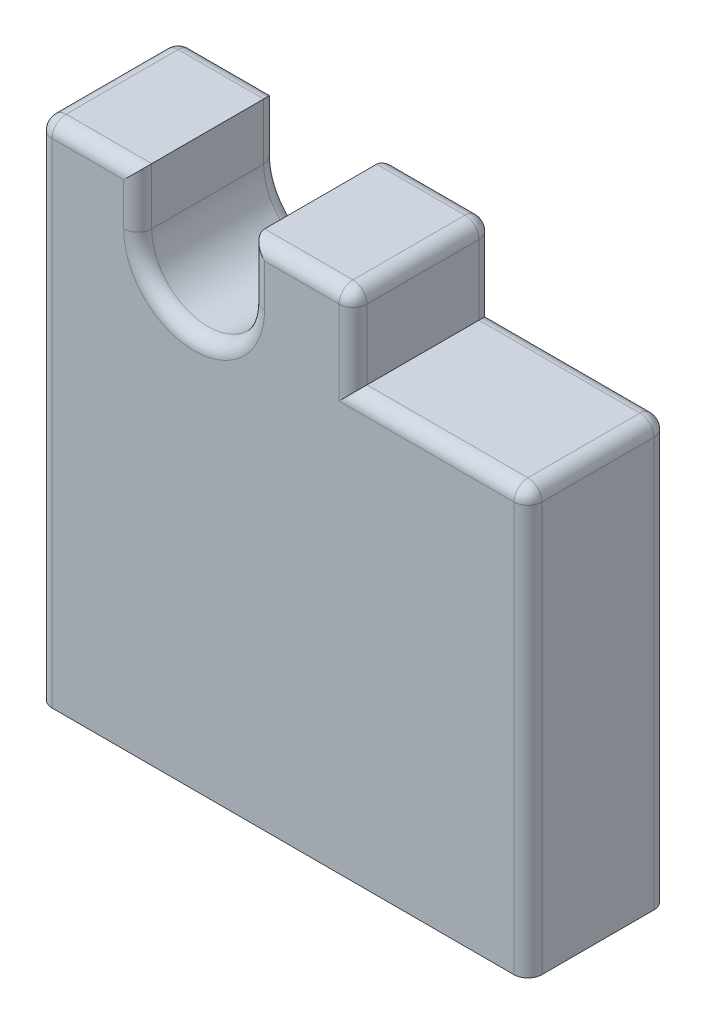
ISO-10303-21;
HEADER;
FILE_DESCRIPTION(('STEP AP214'),'2;1');
FILE_NAME('part.step','',(''),(''),'','','');
FILE_SCHEMA(('AUTOMOTIVE_DESIGN { 1 0 10303 214 1 1 1 1 }'));
ENDSEC;
DATA;
#1=APPLICATION_CONTEXT('core data for automotive mechanical design processes');
#2=APPLICATION_PROTOCOL_DEFINITION('international standard','automotive_design',2000,#1);
#3=PRODUCT_CONTEXT('',#1,'mechanical');
#4=PRODUCT('Part','Part','',(#3));
#5=PRODUCT_RELATED_PRODUCT_CATEGORY('part','',(#4));
#6=PRODUCT_DEFINITION_FORMATION('','',#4);
#7=PRODUCT_DEFINITION_CONTEXT('part definition',#1,'design');
#8=PRODUCT_DEFINITION('design','',#6,#7);
#9=PRODUCT_DEFINITION_SHAPE('','',#8);
#10=(LENGTH_UNIT() NAMED_UNIT(*) SI_UNIT(.MILLI.,.METRE.));
#11=(NAMED_UNIT(*) PLANE_ANGLE_UNIT() SI_UNIT($,.RADIAN.));
#12=(NAMED_UNIT(*) SI_UNIT($,.STERADIAN.) SOLID_ANGLE_UNIT());
#13=UNCERTAINTY_MEASURE_WITH_UNIT(LENGTH_MEASURE(1.E-05),#10,'distance_accuracy_value','');
#14=(GEOMETRIC_REPRESENTATION_CONTEXT(3) GLOBAL_UNCERTAINTY_ASSIGNED_CONTEXT((#13)) GLOBAL_UNIT_ASSIGNED_CONTEXT((#10,
#11,#12)) REPRESENTATION_CONTEXT('',''));
#15=CARTESIAN_POINT('',(0.,0.,0.));
#16=DIRECTION('',(0.,0.,1.));
#17=DIRECTION('',(1.,0.,0.));
#18=AXIS2_PLACEMENT_3D('',#15,#16,#17);
#19=CARTESIAN_POINT('',(88.9,0.,25.4));
#20=DIRECTION('',(0.,1.,0.));
#21=DIRECTION('',(0.,0.,1.));
#22=AXIS2_PLACEMENT_3D('',#19,#20,#21);
#23=PLANE('',#22);
#24=DIRECTION('',(0.,0.,-1.));
#25=VECTOR('',#24,1.);
#26=CARTESIAN_POINT('',(0.,0.,25.4));
#27=LINE('',#26,#25);
#28=CARTESIAN_POINT('',(0.,0.,22.86));
#29=VERTEX_POINT('',#28);
#30=CARTESIAN_POINT('',(0.,0.,2.54));
#31=VERTEX_POINT('',#30);
#32=EDGE_CURVE('E523',#29,#31,#27,.T.);
#33=ORIENTED_EDGE('',*,*,#32,.T.);
#34=CARTESIAN_POINT('',(2.54,0.,2.54));
#35=DIRECTION('',(0.,1.,0.));
#36=DIRECTION('',(0.,0.,1.));
#37=AXIS2_PLACEMENT_3D('',#34,#35,#36);
#38=CIRCLE('',#37,2.54);
#39=CARTESIAN_POINT('',(2.54,0.,0.));
#40=VERTEX_POINT('',#39);
#41=EDGE_CURVE('E351',#31,#40,#38,.F.);
#42=ORIENTED_EDGE('',*,*,#41,.T.);
#43=DIRECTION('',(1.,0.,0.));
#44=VECTOR('',#43,1.);
#45=CARTESIAN_POINT('',(88.9,0.,0.));
#46=LINE('',#45,#44);
#47=CARTESIAN_POINT('',(86.36,0.,0.));
#48=VERTEX_POINT('',#47);
#49=EDGE_CURVE('E436',#40,#48,#46,.T.);
#50=ORIENTED_EDGE('',*,*,#49,.T.);
#51=CARTESIAN_POINT('',(86.36,0.,2.54));
#52=DIRECTION('',(0.,1.,0.));
#53=DIRECTION('',(0.,0.,1.));
#54=AXIS2_PLACEMENT_3D('',#51,#52,#53);
#55=CIRCLE('',#54,2.54);
#56=CARTESIAN_POINT('',(88.9,0.,2.54));
#57=VERTEX_POINT('',#56);
#58=EDGE_CURVE('E348',#48,#57,#55,.F.);
#59=ORIENTED_EDGE('',*,*,#58,.T.);
#60=DIRECTION('',(0.,0.,-1.));
#61=VECTOR('',#60,1.);
#62=CARTESIAN_POINT('',(88.9,0.,25.4));
#63=LINE('',#62,#61);
#64=CARTESIAN_POINT('',(88.9,0.,22.86));
#65=VERTEX_POINT('',#64);
#66=EDGE_CURVE('E249',#65,#57,#63,.T.);
#67=ORIENTED_EDGE('',*,*,#66,.F.);
#68=CARTESIAN_POINT('',(86.36,0.,22.86));
#69=DIRECTION('',(0.,1.,0.));
#70=DIRECTION('',(0.,0.,1.));
#71=AXIS2_PLACEMENT_3D('',#68,#69,#70);
#72=CIRCLE('',#71,2.54);
#73=CARTESIAN_POINT('',(86.36,0.,25.4));
#74=VERTEX_POINT('',#73);
#75=EDGE_CURVE('E345',#65,#74,#72,.F.);
#76=ORIENTED_EDGE('',*,*,#75,.T.);
#77=DIRECTION('',(1.,0.,0.));
#78=VECTOR('',#77,1.);
#79=CARTESIAN_POINT('',(88.9,0.,25.4));
#80=LINE('',#79,#78);
#81=CARTESIAN_POINT('',(2.54,0.,25.4));
#82=VERTEX_POINT('',#81);
#83=EDGE_CURVE('E584',#82,#74,#80,.T.);
#84=ORIENTED_EDGE('',*,*,#83,.F.);
#85=CARTESIAN_POINT('',(2.54,0.,22.86));
#86=DIRECTION('',(0.,1.,0.));
#87=DIRECTION('',(0.,0.,1.));
#88=AXIS2_PLACEMENT_3D('',#85,#86,#87);
#89=CIRCLE('',#88,2.54);
#90=EDGE_CURVE('E342',#82,#29,#89,.F.);
#91=ORIENTED_EDGE('',*,*,#90,.T.);
#92=EDGE_LOOP('',(#33,#42,#50,#59,#67,#76,#84,#91));
#93=FACE_BOUND('',#92,.T.);
#94=ADVANCED_FACE('F47',(#93),#23,.F.);
#95=CARTESIAN_POINT('',(88.9,76.835,25.4));
#96=DIRECTION('',(-1.,0.,0.));
#97=DIRECTION('',(0.,-1.,0.));
#98=AXIS2_PLACEMENT_3D('',#95,#96,#97);
#99=PLANE('',#98);
#100=ORIENTED_EDGE('',*,*,#66,.T.);
#101=DIRECTION('',(0.,1.,0.));
#102=VECTOR('',#101,1.);
#103=CARTESIAN_POINT('',(88.9,76.835,2.54));
#104=LINE('',#103,#102);
#105=CARTESIAN_POINT('',(88.9,74.295,2.54));
#106=VERTEX_POINT('',#105);
#107=EDGE_CURVE('E360',#57,#106,#104,.T.);
#108=ORIENTED_EDGE('',*,*,#107,.T.);
#109=DIRECTION('',(0.,0.,-1.));
#110=VECTOR('',#109,1.);
#111=CARTESIAN_POINT('',(88.9,74.295,25.4));
#112=LINE('',#111,#110);
#113=CARTESIAN_POINT('',(88.9,74.295,22.86));
#114=VERTEX_POINT('',#113);
#115=EDGE_CURVE('E354',#106,#114,#112,.F.);
#116=ORIENTED_EDGE('',*,*,#115,.T.);
#117=DIRECTION('',(0.,1.,0.));
#118=VECTOR('',#117,1.);
#119=CARTESIAN_POINT('',(88.9,0.,22.86));
#120=LINE('',#119,#118);
#121=EDGE_CURVE('E357',#114,#65,#120,.F.);
#122=ORIENTED_EDGE('',*,*,#121,.T.);
#123=EDGE_LOOP('',(#100,#108,#116,#122));
#124=FACE_BOUND('',#123,.T.);
#125=ADVANCED_FACE('F619',(#124),#99,.F.);
#126=CARTESIAN_POINT('',(57.15,76.835,25.4));
#127=DIRECTION('',(0.,-1.,0.));
#128=DIRECTION('',(0.,0.,-1.));
#129=AXIS2_PLACEMENT_3D('',#126,#127,#128);
#130=PLANE('',#129);
#131=DIRECTION('',(0.,0.,-1.));
#132=VECTOR('',#131,1.);
#133=CARTESIAN_POINT('',(86.36,76.835,25.4));
#134=LINE('',#133,#132);
#135=CARTESIAN_POINT('',(86.36,76.835,22.86));
#136=VERTEX_POINT('',#135);
#137=CARTESIAN_POINT('',(86.36,76.835,2.54));
#138=VERTEX_POINT('',#137);
#139=EDGE_CURVE('E370',#136,#138,#134,.T.);
#140=ORIENTED_EDGE('',*,*,#139,.T.);
#141=DIRECTION('',(-1.,0.,0.));
#142=VECTOR('',#141,1.);
#143=CARTESIAN_POINT('',(57.15,76.835,2.54));
#144=LINE('',#143,#142);
#145=CARTESIAN_POINT('',(57.15,76.835,2.54));
#146=VERTEX_POINT('',#145);
#147=EDGE_CURVE('E376',#138,#146,#144,.T.);
#148=ORIENTED_EDGE('',*,*,#147,.T.);
#149=DIRECTION('',(0.,0.,-1.));
#150=VECTOR('',#149,1.);
#151=CARTESIAN_POINT('',(57.15,76.835,25.4));
#152=LINE('',#151,#150);
#153=CARTESIAN_POINT('',(57.15,76.835,22.86));
#154=VERTEX_POINT('',#153);
#155=EDGE_CURVE('E256',#154,#146,#152,.T.);
#156=ORIENTED_EDGE('',*,*,#155,.F.);
#157=DIRECTION('',(-1.,0.,0.));
#158=VECTOR('',#157,1.);
#159=CARTESIAN_POINT('',(88.9,76.835,22.86));
#160=LINE('',#159,#158);
#161=EDGE_CURVE('E373',#154,#136,#160,.F.);
#162=ORIENTED_EDGE('',*,*,#161,.T.);
#163=EDGE_LOOP('',(#140,#148,#156,#162));
#164=FACE_BOUND('',#163,.T.);
#165=ADVANCED_FACE('F565',(#164),#130,.F.);
#166=CARTESIAN_POINT('',(57.15,92.075,25.4));
#167=DIRECTION('',(-1.,0.,0.));
#168=DIRECTION('',(0.,0.,1.));
#169=AXIS2_PLACEMENT_3D('',#166,#167,#168);
#170=PLANE('',#169);
#171=DIRECTION('',(0.,1.,0.));
#172=VECTOR('',#171,1.);
#173=CARTESIAN_POINT('',(57.15,92.075,2.54));
#174=LINE('',#173,#172);
#175=CARTESIAN_POINT('',(57.15,89.535,2.54));
#176=VERTEX_POINT('',#175);
#177=EDGE_CURVE('E366',#146,#176,#174,.T.);
#178=ORIENTED_EDGE('',*,*,#177,.T.);
#179=DIRECTION('',(0.,0.,-1.));
#180=VECTOR('',#179,1.);
#181=CARTESIAN_POINT('',(57.15,89.535,25.4));
#182=LINE('',#181,#180);
#183=CARTESIAN_POINT('',(57.15,89.535,22.86));
#184=VERTEX_POINT('',#183);
#185=EDGE_CURVE('E464',#176,#184,#182,.F.);
#186=ORIENTED_EDGE('',*,*,#185,.T.);
#187=DIRECTION('',(0.,1.,0.));
#188=VECTOR('',#187,1.);
#189=CARTESIAN_POINT('',(57.15,76.835,22.86));
#190=LINE('',#189,#188);
#191=EDGE_CURVE('E363',#184,#154,#190,.F.);
#192=ORIENTED_EDGE('',*,*,#191,.T.);
#193=ORIENTED_EDGE('',*,*,#155,.T.);
#194=EDGE_LOOP('',(#178,#186,#192,#193));
#195=FACE_BOUND('',#194,.T.);
#196=ADVANCED_FACE('F533',(#195),#170,.F.);
#197=CARTESIAN_POINT('',(38.575,92.075,25.4));
#198=DIRECTION('',(0.,-1.,0.));
#199=DIRECTION('',(0.,0.,-1.));
#200=AXIS2_PLACEMENT_3D('',#197,#198,#199);
#201=PLANE('',#200);
#202=DIRECTION('',(-1.,0.,0.));
#203=VECTOR('',#202,1.);
#204=CARTESIAN_POINT('',(57.15,92.075,22.86));
#205=LINE('',#204,#203);
#206=CARTESIAN_POINT('',(38.575,92.075,22.86));
#207=VERTEX_POINT('',#206);
#208=CARTESIAN_POINT('',(54.61,92.075,22.86));
#209=VERTEX_POINT('',#208);
#210=EDGE_CURVE('E329',#207,#209,#205,.F.);
#211=ORIENTED_EDGE('',*,*,#210,.T.);
#212=DIRECTION('',(0.,0.,-1.));
#213=VECTOR('',#212,1.);
#214=CARTESIAN_POINT('',(54.61,92.075,25.4));
#215=LINE('',#214,#213);
#216=CARTESIAN_POINT('',(54.61,92.075,2.54));
#217=VERTEX_POINT('',#216);
#218=EDGE_CURVE('E461',#209,#217,#215,.T.);
#219=ORIENTED_EDGE('',*,*,#218,.T.);
#220=DIRECTION('',(-1.,0.,0.));
#221=VECTOR('',#220,1.);
#222=CARTESIAN_POINT('',(38.575,92.075,2.54));
#223=LINE('',#222,#221);
#224=CARTESIAN_POINT('',(38.575,92.075,2.54));
#225=VERTEX_POINT('',#224);
#226=EDGE_CURVE('E333',#217,#225,#223,.T.);
#227=ORIENTED_EDGE('',*,*,#226,.T.);
#228=DIRECTION('',(0.,0.,-1.));
#229=VECTOR('',#228,1.);
#230=CARTESIAN_POINT('',(38.575,92.075,25.4));
#231=LINE('',#230,#229);
#232=EDGE_CURVE('E231',#207,#225,#231,.T.);
#233=ORIENTED_EDGE('',*,*,#232,.F.);
#234=EDGE_LOOP('',(#211,#219,#227,#233));
#235=FACE_BOUND('',#234,.T.);
#236=ADVANCED_FACE('F737',(#235),#201,.F.);
#237=CARTESIAN_POINT('',(38.575,81.825,25.4));
#238=DIRECTION('',(1.,0.,0.));
#239=DIRECTION('',(0.,0.,-1.));
#240=AXIS2_PLACEMENT_3D('',#237,#238,#239);
#241=PLANE('',#240);
#242=ORIENTED_EDGE('',*,*,#232,.T.);
#243=DIRECTION('',(0.,-1.,0.));
#244=VECTOR('',#243,1.);
#245=CARTESIAN_POINT('',(38.575,81.825,2.54));
#246=LINE('',#245,#244);
#247=CARTESIAN_POINT('',(38.575,81.825,2.54));
#248=VERTEX_POINT('',#247);
#249=EDGE_CURVE('E229',#225,#248,#246,.T.);
#250=ORIENTED_EDGE('',*,*,#249,.T.);
#251=DIRECTION('',(0.,0.,-1.));
#252=VECTOR('',#251,1.);
#253=CARTESIAN_POINT('',(38.575,81.825,25.4));
#254=LINE('',#253,#252);
#255=CARTESIAN_POINT('',(38.575,81.825,22.86));
#256=VERTEX_POINT('',#255);
#257=EDGE_CURVE('E210',#256,#248,#254,.T.);
#258=ORIENTED_EDGE('',*,*,#257,.F.);
#259=DIRECTION('',(0.,-1.,0.));
#260=VECTOR('',#259,1.);
#261=CARTESIAN_POINT('',(38.575,92.075,22.86));
#262=LINE('',#261,#260);
#263=EDGE_CURVE('E226',#256,#207,#262,.F.);
#264=ORIENTED_EDGE('',*,*,#263,.T.);
#265=EDGE_LOOP('',(#242,#250,#258,#264));
#266=FACE_BOUND('',#265,.T.);
#267=ADVANCED_FACE('F224',(#266),#241,.F.);
#268=CARTESIAN_POINT('',(28.325,81.825,25.4));
#269=DIRECTION('',(0.,0.,-1.));
#270=DIRECTION('',(-1.,0.,0.));
#271=AXIS2_PLACEMENT_3D('',#268,#269,#270);
#272=CYLINDRICAL_SURFACE('',#271,10.25);
#273=ORIENTED_EDGE('',*,*,#257,.T.);
#274=CARTESIAN_POINT('',(28.325,81.825,2.54));
#275=DIRECTION('',(0.,0.,1.));
#276=DIRECTION('',(1.,0.,0.));
#277=AXIS2_PLACEMENT_3D('',#274,#275,#276);
#278=CIRCLE('',#277,10.25);
#279=CARTESIAN_POINT('',(18.075,81.825,2.54));
#280=VERTEX_POINT('',#279);
#281=EDGE_CURVE('E218',#248,#280,#278,.F.);
#282=ORIENTED_EDGE('',*,*,#281,.T.);
#283=DIRECTION('',(0.,0.,-1.));
#284=VECTOR('',#283,1.);
#285=CARTESIAN_POINT('',(18.075,81.825,25.4));
#286=LINE('',#285,#284);
#287=CARTESIAN_POINT('',(18.075,81.825,22.86));
#288=VERTEX_POINT('',#287);
#289=EDGE_CURVE('E212',#288,#280,#286,.T.);
#290=ORIENTED_EDGE('',*,*,#289,.F.);
#291=CARTESIAN_POINT('',(28.325,81.825,22.86));
#292=DIRECTION('',(0.,0.,1.));
#293=DIRECTION('',(1.,0.,0.));
#294=AXIS2_PLACEMENT_3D('',#291,#292,#293);
#295=CIRCLE('',#294,10.25);
#296=EDGE_CURVE('E207',#288,#256,#295,.T.);
#297=ORIENTED_EDGE('',*,*,#296,.T.);
#298=EDGE_LOOP('',(#273,#282,#290,#297));
#299=FACE_BOUND('',#298,.T.);
#300=ADVANCED_FACE('F209',(#299),#272,.F.);
#301=CARTESIAN_POINT('',(18.075,92.075,25.4));
#302=DIRECTION('',(-1.,0.,0.));
#303=DIRECTION('',(0.,0.,1.));
#304=AXIS2_PLACEMENT_3D('',#301,#302,#303);
#305=PLANE('',#304);
#306=ORIENTED_EDGE('',*,*,#289,.T.);
#307=DIRECTION('',(0.,1.,0.));
#308=VECTOR('',#307,1.);
#309=CARTESIAN_POINT('',(18.075,92.075,2.54));
#310=LINE('',#309,#308);
#311=CARTESIAN_POINT('',(18.075,92.075,2.54));
#312=VERTEX_POINT('',#311);
#313=EDGE_CURVE('E291',#280,#312,#310,.T.);
#314=ORIENTED_EDGE('',*,*,#313,.T.);
#315=DIRECTION('',(0.,0.,-1.));
#316=VECTOR('',#315,1.);
#317=CARTESIAN_POINT('',(18.075,92.075,25.4));
#318=LINE('',#317,#316);
#319=CARTESIAN_POINT('',(18.075,92.075,22.86));
#320=VERTEX_POINT('',#319);
#321=EDGE_CURVE('E520',#320,#312,#318,.T.);
#322=ORIENTED_EDGE('',*,*,#321,.F.);
#323=DIRECTION('',(0.,1.,0.));
#324=VECTOR('',#323,1.);
#325=CARTESIAN_POINT('',(18.075,81.825,22.86));
#326=LINE('',#325,#324);
#327=EDGE_CURVE('E288',#320,#288,#326,.F.);
#328=ORIENTED_EDGE('',*,*,#327,.T.);
#329=EDGE_LOOP('',(#306,#314,#322,#328));
#330=FACE_BOUND('',#329,.T.);
#331=ADVANCED_FACE('F515',(#330),#305,.F.);
#332=CARTESIAN_POINT('',(0.,92.075,25.4));
#333=DIRECTION('',(0.,-1.,0.));
#334=DIRECTION('',(0.,0.,-1.));
#335=AXIS2_PLACEMENT_3D('',#332,#333,#334);
#336=PLANE('',#335);
#337=DIRECTION('',(-1.,0.,0.));
#338=VECTOR('',#337,1.);
#339=CARTESIAN_POINT('',(0.,92.075,2.54));
#340=LINE('',#339,#338);
#341=CARTESIAN_POINT('',(2.54,92.075,2.54));
#342=VERTEX_POINT('',#341);
#343=EDGE_CURVE('E326',#312,#342,#340,.T.);
#344=ORIENTED_EDGE('',*,*,#343,.T.);
#345=DIRECTION('',(0.,0.,-1.));
#346=VECTOR('',#345,1.);
#347=CARTESIAN_POINT('',(2.54,92.075,25.4));
#348=LINE('',#347,#346);
#349=CARTESIAN_POINT('',(2.54,92.075,22.86));
#350=VERTEX_POINT('',#349);
#351=EDGE_CURVE('E11',#342,#350,#348,.F.);
#352=ORIENTED_EDGE('',*,*,#351,.T.);
#353=DIRECTION('',(-1.,0.,0.));
#354=VECTOR('',#353,1.);
#355=CARTESIAN_POINT('',(18.075,92.075,22.86));
#356=LINE('',#355,#354);
#357=EDGE_CURVE('E323',#350,#320,#356,.F.);
#358=ORIENTED_EDGE('',*,*,#357,.T.);
#359=ORIENTED_EDGE('',*,*,#321,.T.);
#360=EDGE_LOOP('',(#344,#352,#358,#359));
#361=FACE_BOUND('',#360,.T.);
#362=ADVANCED_FACE('F752',(#361),#336,.F.);
#363=CARTESIAN_POINT('',(0.,0.,25.4));
#364=DIRECTION('',(1.,0.,0.));
#365=DIRECTION('',(0.,0.,-1.));
#366=AXIS2_PLACEMENT_3D('',#363,#364,#365);
#367=PLANE('',#366);
#368=DIRECTION('',(0.,-1.,0.));
#369=VECTOR('',#368,1.);
#370=CARTESIAN_POINT('',(0.,92.075,22.86));
#371=LINE('',#370,#369);
#372=CARTESIAN_POINT('',(0.,89.535,22.86));
#373=VERTEX_POINT('',#372);
#374=EDGE_CURVE('E336',#29,#373,#371,.F.);
#375=ORIENTED_EDGE('',*,*,#374,.T.);
#376=DIRECTION('',(0.,0.,-1.));
#377=VECTOR('',#376,1.);
#378=CARTESIAN_POINT('',(0.,89.535,25.4));
#379=LINE('',#378,#377);
#380=CARTESIAN_POINT('',(0.,89.535,2.54));
#381=VERTEX_POINT('',#380);
#382=EDGE_CURVE('E57',#373,#381,#379,.T.);
#383=ORIENTED_EDGE('',*,*,#382,.T.);
#384=DIRECTION('',(0.,-1.,0.));
#385=VECTOR('',#384,1.);
#386=CARTESIAN_POINT('',(0.,0.,2.54));
#387=LINE('',#386,#385);
#388=EDGE_CURVE('E339',#381,#31,#387,.T.);
#389=ORIENTED_EDGE('',*,*,#388,.T.);
#390=ORIENTED_EDGE('',*,*,#32,.F.);
#391=EDGE_LOOP('',(#375,#383,#389,#390));
#392=FACE_BOUND('',#391,.T.);
#393=ADVANCED_FACE('F594',(#392),#367,.F.);
#394=CARTESIAN_POINT('',(28.325,81.825,25.4));
#395=DIRECTION('',(0.,0.,1.));
#396=DIRECTION('',(1.,0.,0.));
#397=AXIS2_PLACEMENT_3D('',#394,#395,#396);
#398=PLANE('',#397);
#399=ORIENTED_EDGE('',*,*,#83,.T.);
#400=DIRECTION('',(0.,1.,0.));
#401=VECTOR('',#400,1.);
#402=CARTESIAN_POINT('',(86.36,76.835,25.4));
#403=LINE('',#402,#401);
#404=CARTESIAN_POINT('',(86.36,74.295,25.4));
#405=VERTEX_POINT('',#404);
#406=EDGE_CURVE('E219',#74,#405,#403,.T.);
#407=ORIENTED_EDGE('',*,*,#406,.T.);
#408=DIRECTION('',(-1.,0.,0.));
#409=VECTOR('',#408,1.);
#410=CARTESIAN_POINT('',(57.15,74.295,25.4));
#411=LINE('',#410,#409);
#412=CARTESIAN_POINT('',(54.61,74.295,25.4));
#413=VERTEX_POINT('',#412);
#414=EDGE_CURVE('E316',#405,#413,#411,.T.);
#415=ORIENTED_EDGE('',*,*,#414,.T.);
#416=DIRECTION('',(0.,1.,0.));
#417=VECTOR('',#416,1.);
#418=CARTESIAN_POINT('',(54.61,92.075,25.4));
#419=LINE('',#418,#417);
#420=CARTESIAN_POINT('',(54.61,89.535,25.4));
#421=VERTEX_POINT('',#420);
#422=EDGE_CURVE('E312',#413,#421,#419,.T.);
#423=ORIENTED_EDGE('',*,*,#422,.T.);
#424=DIRECTION('',(-1.,0.,0.));
#425=VECTOR('',#424,1.);
#426=CARTESIAN_POINT('',(38.575,89.535,25.4));
#427=LINE('',#426,#425);
#428=CARTESIAN_POINT('',(41.115,89.535,25.4));
#429=VERTEX_POINT('',#428);
#430=EDGE_CURVE('E309',#421,#429,#427,.T.);
#431=ORIENTED_EDGE('',*,*,#430,.T.);
#432=DIRECTION('',(0.,-1.,0.));
#433=VECTOR('',#432,1.);
#434=CARTESIAN_POINT('',(41.115,81.825,25.4));
#435=LINE('',#434,#433);
#436=CARTESIAN_POINT('',(41.115,81.825,25.4));
#437=VERTEX_POINT('',#436);
#438=EDGE_CURVE('E306',#429,#437,#435,.T.);
#439=ORIENTED_EDGE('',*,*,#438,.T.);
#440=CARTESIAN_POINT('',(28.325,81.825,25.4));
#441=DIRECTION('',(0.,0.,1.));
#442=DIRECTION('',(1.,0.,0.));
#443=AXIS2_PLACEMENT_3D('',#440,#441,#442);
#444=CIRCLE('',#443,12.79);
#445=CARTESIAN_POINT('',(15.535,81.825,25.4));
#446=VERTEX_POINT('',#445);
#447=EDGE_CURVE('E237',#437,#446,#444,.F.);
#448=ORIENTED_EDGE('',*,*,#447,.T.);
#449=DIRECTION('',(0.,1.,0.));
#450=VECTOR('',#449,1.);
#451=CARTESIAN_POINT('',(15.535,92.075,25.4));
#452=LINE('',#451,#450);
#453=CARTESIAN_POINT('',(15.535,89.535,25.4));
#454=VERTEX_POINT('',#453);
#455=EDGE_CURVE('E301',#446,#454,#452,.T.);
#456=ORIENTED_EDGE('',*,*,#455,.T.);
#457=DIRECTION('',(-1.,0.,0.));
#458=VECTOR('',#457,1.);
#459=CARTESIAN_POINT('',(0.,89.535,25.4));
#460=LINE('',#459,#458);
#461=CARTESIAN_POINT('',(2.54,89.535,25.4));
#462=VERTEX_POINT('',#461);
#463=EDGE_CURVE('E297',#454,#462,#460,.T.);
#464=ORIENTED_EDGE('',*,*,#463,.T.);
#465=DIRECTION('',(0.,-1.,0.));
#466=VECTOR('',#465,1.);
#467=CARTESIAN_POINT('',(2.54,0.,25.4));
#468=LINE('',#467,#466);
#469=EDGE_CURVE('E294',#462,#82,#468,.T.);
#470=ORIENTED_EDGE('',*,*,#469,.T.);
#471=EDGE_LOOP('',(#399,#407,#415,#423,#431,#439,#448,#456,#464,#470));
#472=FACE_BOUND('',#471,.T.);
#473=ADVANCED_FACE('F605',(#472),#398,.T.);
#474=CARTESIAN_POINT('',(28.325,81.825,0.));
#475=DIRECTION('',(0.,0.,1.));
#476=DIRECTION('',(1.,0.,0.));
#477=AXIS2_PLACEMENT_3D('',#474,#475,#476);
#478=PLANE('',#477);
#479=ORIENTED_EDGE('',*,*,#49,.F.);
#480=DIRECTION('',(0.,-1.,0.));
#481=VECTOR('',#480,1.);
#482=CARTESIAN_POINT('',(2.54,81.825,0.));
#483=LINE('',#482,#481);
#484=CARTESIAN_POINT('',(2.54,89.535,0.));
#485=VERTEX_POINT('',#484);
#486=EDGE_CURVE('E284',#40,#485,#483,.F.);
#487=ORIENTED_EDGE('',*,*,#486,.T.);
#488=DIRECTION('',(-1.,0.,0.));
#489=VECTOR('',#488,1.);
#490=CARTESIAN_POINT('',(28.325,89.535,0.));
#491=LINE('',#490,#489);
#492=CARTESIAN_POINT('',(15.535,89.535,0.));
#493=VERTEX_POINT('',#492);
#494=EDGE_CURVE('E281',#485,#493,#491,.F.);
#495=ORIENTED_EDGE('',*,*,#494,.T.);
#496=DIRECTION('',(0.,1.,0.));
#497=VECTOR('',#496,1.);
#498=CARTESIAN_POINT('',(15.535,81.825,0.));
#499=LINE('',#498,#497);
#500=CARTESIAN_POINT('',(15.535,81.825,0.));
#501=VERTEX_POINT('',#500);
#502=EDGE_CURVE('E278',#493,#501,#499,.F.);
#503=ORIENTED_EDGE('',*,*,#502,.T.);
#504=CARTESIAN_POINT('',(28.325,81.825,0.));
#505=DIRECTION('',(0.,0.,1.));
#506=DIRECTION('',(1.,0.,0.));
#507=AXIS2_PLACEMENT_3D('',#504,#505,#506);
#508=CIRCLE('',#507,12.79);
#509=CARTESIAN_POINT('',(41.115,81.825,0.));
#510=VERTEX_POINT('',#509);
#511=EDGE_CURVE('E275',#501,#510,#508,.T.);
#512=ORIENTED_EDGE('',*,*,#511,.T.);
#513=DIRECTION('',(0.,-1.,0.));
#514=VECTOR('',#513,1.);
#515=CARTESIAN_POINT('',(41.115,81.825,0.));
#516=LINE('',#515,#514);
#517=CARTESIAN_POINT('',(41.115,89.535,0.));
#518=VERTEX_POINT('',#517);
#519=EDGE_CURVE('E272',#510,#518,#516,.F.);
#520=ORIENTED_EDGE('',*,*,#519,.T.);
#521=DIRECTION('',(-1.,0.,0.));
#522=VECTOR('',#521,1.);
#523=CARTESIAN_POINT('',(28.325,89.535,0.));
#524=LINE('',#523,#522);
#525=CARTESIAN_POINT('',(54.61,89.535,0.));
#526=VERTEX_POINT('',#525);
#527=EDGE_CURVE('E268',#518,#526,#524,.F.);
#528=ORIENTED_EDGE('',*,*,#527,.T.);
#529=DIRECTION('',(0.,1.,0.));
#530=VECTOR('',#529,1.);
#531=CARTESIAN_POINT('',(54.61,81.825,0.));
#532=LINE('',#531,#530);
#533=CARTESIAN_POINT('',(54.61,74.295,0.));
#534=VERTEX_POINT('',#533);
#535=EDGE_CURVE('E262',#526,#534,#532,.F.);
#536=ORIENTED_EDGE('',*,*,#535,.T.);
#537=DIRECTION('',(-1.,0.,0.));
#538=VECTOR('',#537,1.);
#539=CARTESIAN_POINT('',(28.325,74.295,0.));
#540=LINE('',#539,#538);
#541=CARTESIAN_POINT('',(86.36,74.295,0.));
#542=VERTEX_POINT('',#541);
#543=EDGE_CURVE('E253',#534,#542,#540,.F.);
#544=ORIENTED_EDGE('',*,*,#543,.T.);
#545=DIRECTION('',(0.,1.,0.));
#546=VECTOR('',#545,1.);
#547=CARTESIAN_POINT('',(86.36,81.825,0.));
#548=LINE('',#547,#546);
#549=EDGE_CURVE('E265',#542,#48,#548,.F.);
#550=ORIENTED_EDGE('',*,*,#549,.T.);
#551=EDGE_LOOP('',(#479,#487,#495,#503,#512,#520,#528,#536,#544,#550));
#552=FACE_BOUND('',#551,.T.);
#553=ADVANCED_FACE('F495',(#552),#478,.F.);
#554=CARTESIAN_POINT('',(2.54,81.825,22.86));
#555=DIRECTION('',(0.,1.,0.));
#556=DIRECTION('',(0.,0.,1.));
#557=AXIS2_PLACEMENT_3D('',#554,#555,#556);
#558=CYLINDRICAL_SURFACE('',#557,2.54);
#559=ORIENTED_EDGE('',*,*,#469,.F.);
#560=CARTESIAN_POINT('',(2.54,89.535,22.86));
#561=DIRECTION('',(0.,1.,0.));
#562=DIRECTION('',(0.,0.,1.));
#563=AXIS2_PLACEMENT_3D('',#560,#561,#562);
#564=CIRCLE('',#563,2.54);
#565=EDGE_CURVE('E453',#462,#373,#564,.F.);
#566=ORIENTED_EDGE('',*,*,#565,.T.);
#567=ORIENTED_EDGE('',*,*,#374,.F.);
#568=ORIENTED_EDGE('',*,*,#90,.F.);
#569=EDGE_LOOP('',(#559,#566,#567,#568));
#570=FACE_BOUND('',#569,.T.);
#571=ADVANCED_FACE('F597',(#570),#558,.T.);
#572=CARTESIAN_POINT('',(28.325,89.535,22.86));
#573=DIRECTION('',(1.,0.,0.));
#574=DIRECTION('',(0.,0.,-1.));
#575=AXIS2_PLACEMENT_3D('',#572,#573,#574);
#576=CYLINDRICAL_SURFACE('',#575,2.54);
#577=ORIENTED_EDGE('',*,*,#357,.F.);
#578=CARTESIAN_POINT('',(2.54,89.535,22.86));
#579=DIRECTION('',(1.,0.,0.));
#580=DIRECTION('',(0.,0.,-1.));
#581=AXIS2_PLACEMENT_3D('',#578,#579,#580);
#582=CIRCLE('',#581,2.54);
#583=EDGE_CURVE('E449',#350,#462,#582,.T.);
#584=ORIENTED_EDGE('',*,*,#583,.T.);
#585=ORIENTED_EDGE('',*,*,#463,.F.);
#586=CARTESIAN_POINT('',(15.535,89.535,22.86));
#587=DIRECTION('',(0.707106781186547,-0.707106781186547,0.));
#588=DIRECTION('',(0.707106781186547,0.707106781186547,0.));
#589=AXIS2_PLACEMENT_3D('',#586,#587,#588);
#590=ELLIPSE('',#589,3.59210244842766,2.54);
#591=EDGE_CURVE('E432',#320,#454,#590,.T.);
#592=ORIENTED_EDGE('',*,*,#591,.F.);
#593=EDGE_LOOP('',(#577,#584,#585,#592));
#594=FACE_BOUND('',#593,.T.);
#595=ADVANCED_FACE('F602',(#594),#576,.T.);
#596=CARTESIAN_POINT('',(15.535,81.825,22.86));
#597=DIRECTION('',(0.,-1.,0.));
#598=DIRECTION('',(0.,0.,-1.));
#599=AXIS2_PLACEMENT_3D('',#596,#597,#598);
#600=CYLINDRICAL_SURFACE('',#599,2.54);
#601=ORIENTED_EDGE('',*,*,#591,.T.);
#602=ORIENTED_EDGE('',*,*,#455,.F.);
#603=CARTESIAN_POINT('',(15.535,81.825,22.86));
#604=DIRECTION('',(0.,-1.,0.));
#605=DIRECTION('',(0.,0.,-1.));
#606=AXIS2_PLACEMENT_3D('',#603,#604,#605);
#607=CIRCLE('',#606,2.54);
#608=EDGE_CURVE('E241',#288,#446,#607,.T.);
#609=ORIENTED_EDGE('',*,*,#608,.F.);
#610=ORIENTED_EDGE('',*,*,#327,.F.);
#611=EDGE_LOOP('',(#601,#602,#609,#610));
#612=FACE_BOUND('',#611,.T.);
#613=ADVANCED_FACE('F608',(#612),#600,.T.);
#614=CARTESIAN_POINT('',(28.325,81.825,22.86));
#615=DIRECTION('',(0.,0.,1.));
#616=DIRECTION('',(1.,0.,0.));
#617=AXIS2_PLACEMENT_3D('',#614,#615,#616);
#618=TOROIDAL_SURFACE('',#617,12.79,2.54);
#619=ORIENTED_EDGE('',*,*,#608,.T.);
#620=ORIENTED_EDGE('',*,*,#447,.F.);
#621=CARTESIAN_POINT('',(41.115,81.825,22.86));
#622=DIRECTION('',(0.,1.,0.));
#623=DIRECTION('',(0.,0.,1.));
#624=AXIS2_PLACEMENT_3D('',#621,#622,#623);
#625=CIRCLE('',#624,2.54);
#626=EDGE_CURVE('E235',#256,#437,#625,.T.);
#627=ORIENTED_EDGE('',*,*,#626,.F.);
#628=ORIENTED_EDGE('',*,*,#296,.F.);
#629=EDGE_LOOP('',(#619,#620,#627,#628));
#630=FACE_BOUND('',#629,.T.);
#631=ADVANCED_FACE('F236',(#630),#618,.T.);
#632=CARTESIAN_POINT('',(41.115,81.825,22.86));
#633=DIRECTION('',(0.,1.,0.));
#634=DIRECTION('',(0.,0.,1.));
#635=AXIS2_PLACEMENT_3D('',#632,#633,#634);
#636=CYLINDRICAL_SURFACE('',#635,2.54);
#637=ORIENTED_EDGE('',*,*,#626,.T.);
#638=ORIENTED_EDGE('',*,*,#438,.F.);
#639=CARTESIAN_POINT('',(41.115,89.535,22.86));
#640=DIRECTION('',(0.707106781186547,0.707106781186547,0.));
#641=DIRECTION('',(0.707106781186547,-0.707106781186547,0.));
#642=AXIS2_PLACEMENT_3D('',#639,#640,#641);
#643=ELLIPSE('',#642,3.59210244842766,2.54);
#644=EDGE_CURVE('E242',#207,#429,#643,.T.);
#645=ORIENTED_EDGE('',*,*,#644,.F.);
#646=ORIENTED_EDGE('',*,*,#263,.F.);
#647=EDGE_LOOP('',(#637,#638,#645,#646));
#648=FACE_BOUND('',#647,.T.);
#649=ADVANCED_FACE('F245',(#648),#636,.T.);
#650=CARTESIAN_POINT('',(28.325,89.535,22.86));
#651=DIRECTION('',(1.,0.,0.));
#652=DIRECTION('',(0.,0.,-1.));
#653=AXIS2_PLACEMENT_3D('',#650,#651,#652);
#654=CYLINDRICAL_SURFACE('',#653,2.54);
#655=ORIENTED_EDGE('',*,*,#430,.F.);
#656=CARTESIAN_POINT('',(54.61,89.535,22.86));
#657=DIRECTION('',(1.,0.,0.));
#658=DIRECTION('',(0.,0.,-1.));
#659=AXIS2_PLACEMENT_3D('',#656,#657,#658);
#660=CIRCLE('',#659,2.54);
#661=EDGE_CURVE('E440',#421,#209,#660,.F.);
#662=ORIENTED_EDGE('',*,*,#661,.T.);
#663=ORIENTED_EDGE('',*,*,#210,.F.);
#664=ORIENTED_EDGE('',*,*,#644,.T.);
#665=EDGE_LOOP('',(#655,#662,#663,#664));
#666=FACE_BOUND('',#665,.T.);
#667=ADVANCED_FACE('F664',(#666),#654,.T.);
#668=CARTESIAN_POINT('',(54.61,81.825,22.86));
#669=DIRECTION('',(0.,-1.,0.));
#670=DIRECTION('',(0.,0.,-1.));
#671=AXIS2_PLACEMENT_3D('',#668,#669,#670);
#672=CYLINDRICAL_SURFACE('',#671,2.54);
#673=ORIENTED_EDGE('',*,*,#191,.F.);
#674=CARTESIAN_POINT('',(54.61,89.535,22.86));
#675=DIRECTION('',(0.,-1.,0.));
#676=DIRECTION('',(0.,0.,-1.));
#677=AXIS2_PLACEMENT_3D('',#674,#675,#676);
#678=CIRCLE('',#677,2.54);
#679=EDGE_CURVE('E379',#184,#421,#678,.T.);
#680=ORIENTED_EDGE('',*,*,#679,.T.);
#681=ORIENTED_EDGE('',*,*,#422,.F.);
#682=CARTESIAN_POINT('',(54.61,74.295,22.86));
#683=DIRECTION('',(0.707106781186547,-0.707106781186547,0.));
#684=DIRECTION('',(-0.707106781186547,-0.707106781186547,0.));
#685=AXIS2_PLACEMENT_3D('',#682,#683,#684);
#686=ELLIPSE('',#685,3.59210244842766,2.54);
#687=EDGE_CURVE('E424',#154,#413,#686,.T.);
#688=ORIENTED_EDGE('',*,*,#687,.F.);
#689=EDGE_LOOP('',(#673,#680,#681,#688));
#690=FACE_BOUND('',#689,.T.);
#691=ADVANCED_FACE('F557',(#690),#672,.T.);
#692=CARTESIAN_POINT('',(86.36,81.825,22.86));
#693=DIRECTION('',(0.,-1.,0.));
#694=DIRECTION('',(1.,0.,0.));
#695=AXIS2_PLACEMENT_3D('',#692,#693,#694);
#696=CYLINDRICAL_SURFACE('',#695,2.54);
#697=ORIENTED_EDGE('',*,*,#75,.F.);
#698=ORIENTED_EDGE('',*,*,#121,.F.);
#699=CARTESIAN_POINT('',(86.36,74.295,22.86));
#700=DIRECTION('',(0.,1.,0.));
#701=DIRECTION('',(0.,0.,1.));
#702=AXIS2_PLACEMENT_3D('',#699,#700,#701);
#703=CIRCLE('',#702,2.54);
#704=EDGE_CURVE('E420',#405,#114,#703,.T.);
#705=ORIENTED_EDGE('',*,*,#704,.F.);
#706=ORIENTED_EDGE('',*,*,#406,.F.);
#707=EDGE_LOOP('',(#697,#698,#705,#706));
#708=FACE_BOUND('',#707,.T.);
#709=ADVANCED_FACE('F658',(#708),#696,.T.);
#710=CARTESIAN_POINT('',(28.325,74.295,22.86));
#711=DIRECTION('',(1.,0.,0.));
#712=DIRECTION('',(0.,0.,-1.));
#713=AXIS2_PLACEMENT_3D('',#710,#711,#712);
#714=CYLINDRICAL_SURFACE('',#713,2.54);
#715=ORIENTED_EDGE('',*,*,#687,.T.);
#716=ORIENTED_EDGE('',*,*,#414,.F.);
#717=CARTESIAN_POINT('',(86.36,74.295,22.86));
#718=DIRECTION('',(1.,0.,0.));
#719=DIRECTION('',(0.,0.,-1.));
#720=AXIS2_PLACEMENT_3D('',#717,#718,#719);
#721=CIRCLE('',#720,2.54);
#722=EDGE_CURVE('E416',#136,#405,#721,.T.);
#723=ORIENTED_EDGE('',*,*,#722,.F.);
#724=ORIENTED_EDGE('',*,*,#161,.F.);
#725=EDGE_LOOP('',(#715,#716,#723,#724));
#726=FACE_BOUND('',#725,.T.);
#727=ADVANCED_FACE('F563',(#726),#714,.T.);
#728=CARTESIAN_POINT('',(86.36,74.295,22.86));
#729=DIRECTION('',(0.,0.,1.));
#730=DIRECTION('',(1.,0.,0.));
#731=AXIS2_PLACEMENT_3D('',#728,#729,#730);
#732=SPHERICAL_SURFACE('',#731,2.54);
#733=ORIENTED_EDGE('',*,*,#722,.T.);
#734=ORIENTED_EDGE('',*,*,#704,.T.);
#735=CARTESIAN_POINT('',(86.36,74.295,22.86));
#736=DIRECTION('',(0.,0.,1.));
#737=DIRECTION('',(1.,0.,0.));
#738=AXIS2_PLACEMENT_3D('',#735,#736,#737);
#739=CIRCLE('',#738,2.54);
#740=EDGE_CURVE('E412',#136,#114,#739,.F.);
#741=ORIENTED_EDGE('',*,*,#740,.F.);
#742=EDGE_LOOP('',(#733,#734,#741));
#743=FACE_BOUND('',#742,.T.);
#744=ADVANCED_FACE('F652',(#743),#732,.T.);
#745=CARTESIAN_POINT('',(86.36,76.835,2.54));
#746=DIRECTION('',(0.,1.,0.));
#747=DIRECTION('',(-1.,0.,0.));
#748=AXIS2_PLACEMENT_3D('',#745,#746,#747);
#749=CYLINDRICAL_SURFACE('',#748,2.54);
#750=ORIENTED_EDGE('',*,*,#58,.F.);
#751=ORIENTED_EDGE('',*,*,#549,.F.);
#752=CARTESIAN_POINT('',(86.36,74.295,2.54));
#753=DIRECTION('',(0.,1.,0.));
#754=DIRECTION('',(0.,0.,1.));
#755=AXIS2_PLACEMENT_3D('',#752,#753,#754);
#756=CIRCLE('',#755,2.54);
#757=EDGE_CURVE('E408',#106,#542,#756,.T.);
#758=ORIENTED_EDGE('',*,*,#757,.F.);
#759=ORIENTED_EDGE('',*,*,#107,.F.);
#760=EDGE_LOOP('',(#750,#751,#758,#759));
#761=FACE_BOUND('',#760,.T.);
#762=ADVANCED_FACE('F579',(#761),#749,.T.);
#763=CARTESIAN_POINT('',(86.36,74.295,25.4));
#764=DIRECTION('',(0.,0.,-1.));
#765=DIRECTION('',(-1.,0.,0.));
#766=AXIS2_PLACEMENT_3D('',#763,#764,#765);
#767=CYLINDRICAL_SURFACE('',#766,2.54);
#768=ORIENTED_EDGE('',*,*,#740,.T.);
#769=ORIENTED_EDGE('',*,*,#115,.F.);
#770=CARTESIAN_POINT('',(86.36,74.295,2.54));
#771=DIRECTION('',(0.,0.,-1.));
#772=DIRECTION('',(-1.,0.,0.));
#773=AXIS2_PLACEMENT_3D('',#770,#771,#772);
#774=CIRCLE('',#773,2.54);
#775=EDGE_CURVE('E404',#138,#106,#774,.T.);
#776=ORIENTED_EDGE('',*,*,#775,.F.);
#777=ORIENTED_EDGE('',*,*,#139,.F.);
#778=EDGE_LOOP('',(#768,#769,#776,#777));
#779=FACE_BOUND('',#778,.T.);
#780=ADVANCED_FACE('F571',(#779),#767,.T.);
#781=CARTESIAN_POINT('',(86.36,74.295,2.54));
#782=DIRECTION('',(1.,0.,0.));
#783=DIRECTION('',(0.,0.,-1.));
#784=AXIS2_PLACEMENT_3D('',#781,#782,#783);
#785=SPHERICAL_SURFACE('',#784,2.54);
#786=ORIENTED_EDGE('',*,*,#775,.T.);
#787=ORIENTED_EDGE('',*,*,#757,.T.);
#788=CARTESIAN_POINT('',(86.36,74.295,2.54));
#789=DIRECTION('',(1.,0.,0.));
#790=DIRECTION('',(0.,0.,-1.));
#791=AXIS2_PLACEMENT_3D('',#788,#789,#790);
#792=CIRCLE('',#791,2.54);
#793=EDGE_CURVE('E400',#138,#542,#792,.F.);
#794=ORIENTED_EDGE('',*,*,#793,.F.);
#795=EDGE_LOOP('',(#786,#787,#794));
#796=FACE_BOUND('',#795,.T.);
#797=ADVANCED_FACE('F574',(#796),#785,.T.);
#798=CARTESIAN_POINT('',(2.54,0.,2.54));
#799=DIRECTION('',(0.,-1.,0.));
#800=DIRECTION('',(0.,0.,-1.));
#801=AXIS2_PLACEMENT_3D('',#798,#799,#800);
#802=CYLINDRICAL_SURFACE('',#801,2.54);
#803=ORIENTED_EDGE('',*,*,#388,.F.);
#804=CARTESIAN_POINT('',(2.54,89.535,2.54));
#805=DIRECTION('',(0.,-1.,0.));
#806=DIRECTION('',(0.,0.,-1.));
#807=AXIS2_PLACEMENT_3D('',#804,#805,#806);
#808=CIRCLE('',#807,2.54);
#809=EDGE_CURVE('E458',#381,#485,#808,.T.);
#810=ORIENTED_EDGE('',*,*,#809,.T.);
#811=ORIENTED_EDGE('',*,*,#486,.F.);
#812=ORIENTED_EDGE('',*,*,#41,.F.);
#813=EDGE_LOOP('',(#803,#810,#811,#812));
#814=FACE_BOUND('',#813,.T.);
#815=ADVANCED_FACE('F491',(#814),#802,.T.);
#816=CARTESIAN_POINT('',(57.15,74.295,2.54));
#817=DIRECTION('',(-1.,0.,0.));
#818=DIRECTION('',(0.,0.,1.));
#819=AXIS2_PLACEMENT_3D('',#816,#817,#818);
#820=CYLINDRICAL_SURFACE('',#819,2.54);
#821=ORIENTED_EDGE('',*,*,#793,.T.);
#822=ORIENTED_EDGE('',*,*,#543,.F.);
#823=CARTESIAN_POINT('',(54.61,74.295,2.54));
#824=DIRECTION('',(-0.707106781186547,0.707106781186547,0.));
#825=DIRECTION('',(0.707106781186547,0.707106781186547,0.));
#826=AXIS2_PLACEMENT_3D('',#823,#824,#825);
#827=ELLIPSE('',#826,3.59210244842766,2.54);
#828=EDGE_CURVE('E396',#146,#534,#827,.T.);
#829=ORIENTED_EDGE('',*,*,#828,.F.);
#830=ORIENTED_EDGE('',*,*,#147,.F.);
#831=EDGE_LOOP('',(#821,#822,#829,#830));
#832=FACE_BOUND('',#831,.T.);
#833=ADVANCED_FACE('F542',(#832),#820,.T.);
#834=CARTESIAN_POINT('',(0.,89.535,2.54));
#835=DIRECTION('',(-1.,0.,0.));
#836=DIRECTION('',(0.,0.,1.));
#837=AXIS2_PLACEMENT_3D('',#834,#835,#836);
#838=CYLINDRICAL_SURFACE('',#837,2.54);
#839=ORIENTED_EDGE('',*,*,#494,.F.);
#840=CARTESIAN_POINT('',(2.54,89.535,2.54));
#841=DIRECTION('',(-1.,0.,0.));
#842=DIRECTION('',(0.,0.,1.));
#843=AXIS2_PLACEMENT_3D('',#840,#841,#842);
#844=CIRCLE('',#843,2.54);
#845=EDGE_CURVE('E72',#485,#342,#844,.F.);
#846=ORIENTED_EDGE('',*,*,#845,.T.);
#847=ORIENTED_EDGE('',*,*,#343,.F.);
#848=CARTESIAN_POINT('',(15.535,89.535,2.54));
#849=DIRECTION('',(-0.707106781186547,0.707106781186547,0.));
#850=DIRECTION('',(-0.707106781186547,-0.707106781186547,0.));
#851=AXIS2_PLACEMENT_3D('',#848,#849,#850);
#852=ELLIPSE('',#851,3.59210244842766,2.54);
#853=EDGE_CURVE('E392',#493,#312,#852,.F.);
#854=ORIENTED_EDGE('',*,*,#853,.F.);
#855=EDGE_LOOP('',(#839,#846,#847,#854));
#856=FACE_BOUND('',#855,.T.);
#857=ADVANCED_FACE('F498',(#856),#838,.T.);
#858=CARTESIAN_POINT('',(54.61,92.075,2.54));
#859=DIRECTION('',(0.,1.,0.));
#860=DIRECTION('',(0.,0.,1.));
#861=AXIS2_PLACEMENT_3D('',#858,#859,#860);
#862=CYLINDRICAL_SURFACE('',#861,2.54);
#863=ORIENTED_EDGE('',*,*,#535,.F.);
#864=CARTESIAN_POINT('',(54.61,89.535,2.54));
#865=DIRECTION('',(0.,1.,0.));
#866=DIRECTION('',(0.,0.,1.));
#867=AXIS2_PLACEMENT_3D('',#864,#865,#866);
#868=CIRCLE('',#867,2.54);
#869=EDGE_CURVE('E446',#526,#176,#868,.F.);
#870=ORIENTED_EDGE('',*,*,#869,.T.);
#871=ORIENTED_EDGE('',*,*,#177,.F.);
#872=ORIENTED_EDGE('',*,*,#828,.T.);
#873=EDGE_LOOP('',(#863,#870,#871,#872));
#874=FACE_BOUND('',#873,.T.);
#875=ADVANCED_FACE('F545',(#874),#862,.T.);
#876=CARTESIAN_POINT('',(15.535,92.075,2.54));
#877=DIRECTION('',(0.,1.,0.));
#878=DIRECTION('',(0.,0.,1.));
#879=AXIS2_PLACEMENT_3D('',#876,#877,#878);
#880=CYLINDRICAL_SURFACE('',#879,2.54);
#881=ORIENTED_EDGE('',*,*,#853,.T.);
#882=ORIENTED_EDGE('',*,*,#313,.F.);
#883=CARTESIAN_POINT('',(15.535,81.825,2.54));
#884=DIRECTION('',(0.,-1.,0.));
#885=DIRECTION('',(0.,0.,-1.));
#886=AXIS2_PLACEMENT_3D('',#883,#884,#885);
#887=CIRCLE('',#886,2.54);
#888=EDGE_CURVE('E388',#501,#280,#887,.T.);
#889=ORIENTED_EDGE('',*,*,#888,.F.);
#890=ORIENTED_EDGE('',*,*,#502,.F.);
#891=EDGE_LOOP('',(#881,#882,#889,#890));
#892=FACE_BOUND('',#891,.T.);
#893=ADVANCED_FACE('F503',(#892),#880,.T.);
#894=CARTESIAN_POINT('',(38.575,89.535,2.54));
#895=DIRECTION('',(-1.,0.,0.));
#896=DIRECTION('',(0.,0.,1.));
#897=AXIS2_PLACEMENT_3D('',#894,#895,#896);
#898=CYLINDRICAL_SURFACE('',#897,2.54);
#899=ORIENTED_EDGE('',*,*,#226,.F.);
#900=CARTESIAN_POINT('',(54.61,89.535,2.54));
#901=DIRECTION('',(-1.,0.,0.));
#902=DIRECTION('',(0.,0.,1.));
#903=AXIS2_PLACEMENT_3D('',#900,#901,#902);
#904=CIRCLE('',#903,2.54);
#905=EDGE_CURVE('E443',#217,#526,#904,.T.);
#906=ORIENTED_EDGE('',*,*,#905,.T.);
#907=ORIENTED_EDGE('',*,*,#527,.F.);
#908=CARTESIAN_POINT('',(41.115,89.535,2.54));
#909=DIRECTION('',(-0.707106781186547,-0.707106781186547,0.));
#910=DIRECTION('',(-0.707106781186547,0.707106781186547,0.));
#911=AXIS2_PLACEMENT_3D('',#908,#909,#910);
#912=ELLIPSE('',#911,3.59210244842766,2.54);
#913=EDGE_CURVE('E383',#225,#518,#912,.T.);
#914=ORIENTED_EDGE('',*,*,#913,.F.);
#915=EDGE_LOOP('',(#899,#906,#907,#914));
#916=FACE_BOUND('',#915,.T.);
#917=ADVANCED_FACE('F632',(#916),#898,.T.);
#918=CARTESIAN_POINT('',(28.325,81.825,2.54));
#919=DIRECTION('',(0.,0.,1.));
#920=DIRECTION('',(1.,0.,0.));
#921=AXIS2_PLACEMENT_3D('',#918,#919,#920);
#922=TOROIDAL_SURFACE('',#921,12.79,2.54);
#923=ORIENTED_EDGE('',*,*,#888,.T.);
#924=ORIENTED_EDGE('',*,*,#281,.F.);
#925=CARTESIAN_POINT('',(41.115,81.825,2.54));
#926=DIRECTION('',(0.,1.,0.));
#927=DIRECTION('',(0.,0.,1.));
#928=AXIS2_PLACEMENT_3D('',#925,#926,#927);
#929=CIRCLE('',#928,2.54);
#930=EDGE_CURVE('E380',#510,#248,#929,.T.);
#931=ORIENTED_EDGE('',*,*,#930,.F.);
#932=ORIENTED_EDGE('',*,*,#511,.F.);
#933=EDGE_LOOP('',(#923,#924,#931,#932));
#934=FACE_BOUND('',#933,.T.);
#935=ADVANCED_FACE('F513',(#934),#922,.T.);
#936=CARTESIAN_POINT('',(41.115,81.825,2.54));
#937=DIRECTION('',(0.,-1.,0.));
#938=DIRECTION('',(0.,0.,-1.));
#939=AXIS2_PLACEMENT_3D('',#936,#937,#938);
#940=CYLINDRICAL_SURFACE('',#939,2.54);
#941=ORIENTED_EDGE('',*,*,#913,.T.);
#942=ORIENTED_EDGE('',*,*,#519,.F.);
#943=ORIENTED_EDGE('',*,*,#930,.T.);
#944=ORIENTED_EDGE('',*,*,#249,.F.);
#945=EDGE_LOOP('',(#941,#942,#943,#944));
#946=FACE_BOUND('',#945,.T.);
#947=ADVANCED_FACE('F510',(#946),#940,.T.);
#948=CARTESIAN_POINT('',(54.61,89.535,2.54));
#949=DIRECTION('',(0.,0.,1.));
#950=DIRECTION('',(1.,0.,0.));
#951=AXIS2_PLACEMENT_3D('',#948,#949,#950);
#952=SPHERICAL_SURFACE('',#951,2.54);
#953=ORIENTED_EDGE('',*,*,#869,.F.);
#954=ORIENTED_EDGE('',*,*,#905,.F.);
#955=CARTESIAN_POINT('',(54.61,89.535,2.54));
#956=DIRECTION('',(0.,0.,1.));
#957=DIRECTION('',(1.,0.,0.));
#958=AXIS2_PLACEMENT_3D('',#955,#956,#957);
#959=CIRCLE('',#958,2.54);
#960=EDGE_CURVE('E384',#176,#217,#959,.T.);
#961=ORIENTED_EDGE('',*,*,#960,.F.);
#962=EDGE_LOOP('',(#953,#954,#961));
#963=FACE_BOUND('',#962,.T.);
#964=ADVANCED_FACE('F549',(#963),#952,.T.);
#965=CARTESIAN_POINT('',(54.61,89.535,25.4));
#966=DIRECTION('',(0.,0.,-1.));
#967=DIRECTION('',(-1.,0.,0.));
#968=AXIS2_PLACEMENT_3D('',#965,#966,#967);
#969=CYLINDRICAL_SURFACE('',#968,2.54);
#970=ORIENTED_EDGE('',*,*,#960,.T.);
#971=ORIENTED_EDGE('',*,*,#218,.F.);
#972=CARTESIAN_POINT('',(54.61,89.535,22.86));
#973=DIRECTION('',(0.,0.,1.));
#974=DIRECTION('',(1.,0.,0.));
#975=AXIS2_PLACEMENT_3D('',#972,#973,#974);
#976=CIRCLE('',#975,2.54);
#977=EDGE_CURVE('E469',#184,#209,#976,.T.);
#978=ORIENTED_EDGE('',*,*,#977,.F.);
#979=ORIENTED_EDGE('',*,*,#185,.F.);
#980=EDGE_LOOP('',(#970,#971,#978,#979));
#981=FACE_BOUND('',#980,.T.);
#982=ADVANCED_FACE('F554',(#981),#969,.T.);
#983=CARTESIAN_POINT('',(54.61,89.535,22.86));
#984=DIRECTION('',(0.,0.,1.));
#985=DIRECTION('',(1.,0.,0.));
#986=AXIS2_PLACEMENT_3D('',#983,#984,#985);
#987=SPHERICAL_SURFACE('',#986,2.54);
#988=ORIENTED_EDGE('',*,*,#977,.T.);
#989=ORIENTED_EDGE('',*,*,#661,.F.);
#990=ORIENTED_EDGE('',*,*,#679,.F.);
#991=EDGE_LOOP('',(#988,#989,#990));
#992=FACE_BOUND('',#991,.T.);
#993=ADVANCED_FACE('F828',(#992),#987,.T.);
#994=CARTESIAN_POINT('',(2.54,89.535,2.54));
#995=DIRECTION('',(0.,0.,1.));
#996=DIRECTION('',(1.,0.,0.));
#997=AXIS2_PLACEMENT_3D('',#994,#995,#996);
#998=SPHERICAL_SURFACE('',#997,2.54);
#999=ORIENTED_EDGE('',*,*,#845,.F.);
#1000=ORIENTED_EDGE('',*,*,#809,.F.);
#1001=CARTESIAN_POINT('',(2.54,89.535,2.54));
#1002=DIRECTION('',(0.,0.,1.));
#1003=DIRECTION('',(1.,0.,0.));
#1004=AXIS2_PLACEMENT_3D('',#1001,#1002,#1003);
#1005=CIRCLE('',#1004,2.54);
#1006=EDGE_CURVE('E51',#342,#381,#1005,.T.);
#1007=ORIENTED_EDGE('',*,*,#1006,.F.);
#1008=EDGE_LOOP('',(#999,#1000,#1007));
#1009=FACE_BOUND('',#1008,.T.);
#1010=ADVANCED_FACE('F49',(#1009),#998,.T.);
#1011=CARTESIAN_POINT('',(2.54,89.535,25.4));
#1012=DIRECTION('',(0.,0.,-1.));
#1013=DIRECTION('',(-1.,0.,0.));
#1014=AXIS2_PLACEMENT_3D('',#1011,#1012,#1013);
#1015=CYLINDRICAL_SURFACE('',#1014,2.54);
#1016=ORIENTED_EDGE('',*,*,#1006,.T.);
#1017=ORIENTED_EDGE('',*,*,#382,.F.);
#1018=CARTESIAN_POINT('',(2.54,89.535,22.86));
#1019=DIRECTION('',(0.,0.,1.));
#1020=DIRECTION('',(1.,0.,0.));
#1021=AXIS2_PLACEMENT_3D('',#1018,#1019,#1020);
#1022=CIRCLE('',#1021,2.54);
#1023=EDGE_CURVE('E475',#350,#373,#1022,.T.);
#1024=ORIENTED_EDGE('',*,*,#1023,.F.);
#1025=ORIENTED_EDGE('',*,*,#351,.F.);
#1026=EDGE_LOOP('',(#1016,#1017,#1024,#1025));
#1027=FACE_BOUND('',#1026,.T.);
#1028=ADVANCED_FACE('F486',(#1027),#1015,.T.);
#1029=CARTESIAN_POINT('',(2.54,89.535,22.86));
#1030=DIRECTION('',(0.,0.,1.));
#1031=DIRECTION('',(1.,0.,0.));
#1032=AXIS2_PLACEMENT_3D('',#1029,#1030,#1031);
#1033=SPHERICAL_SURFACE('',#1032,2.54);
#1034=ORIENTED_EDGE('',*,*,#1023,.T.);
#1035=ORIENTED_EDGE('',*,*,#565,.F.);
#1036=ORIENTED_EDGE('',*,*,#583,.F.);
#1037=EDGE_LOOP('',(#1034,#1035,#1036));
#1038=FACE_BOUND('',#1037,.T.);
#1039=ADVANCED_FACE('F598',(#1038),#1033,.T.);
#1040=CLOSED_SHELL('',(#94,#125,#165,#196,#236,#267,#300,#331,#362,#393,#473,#553,#571,#595,
#613,#631,#649,#667,#691,#709,#727,#744,#762,#780,#797,#815,#833,#857,#875,#893,#917,#935,#947,
#964,#982,#993,#1010,#1028,#1039));
#1041=MANIFOLD_SOLID_BREP('B2',#1040);
#1042=ADVANCED_BREP_SHAPE_REPRESENTATION('',(#18,#1041),#14);
#1043=SHAPE_DEFINITION_REPRESENTATION(#9,#1042);
ENDSEC;
END-ISO-10303-21;
